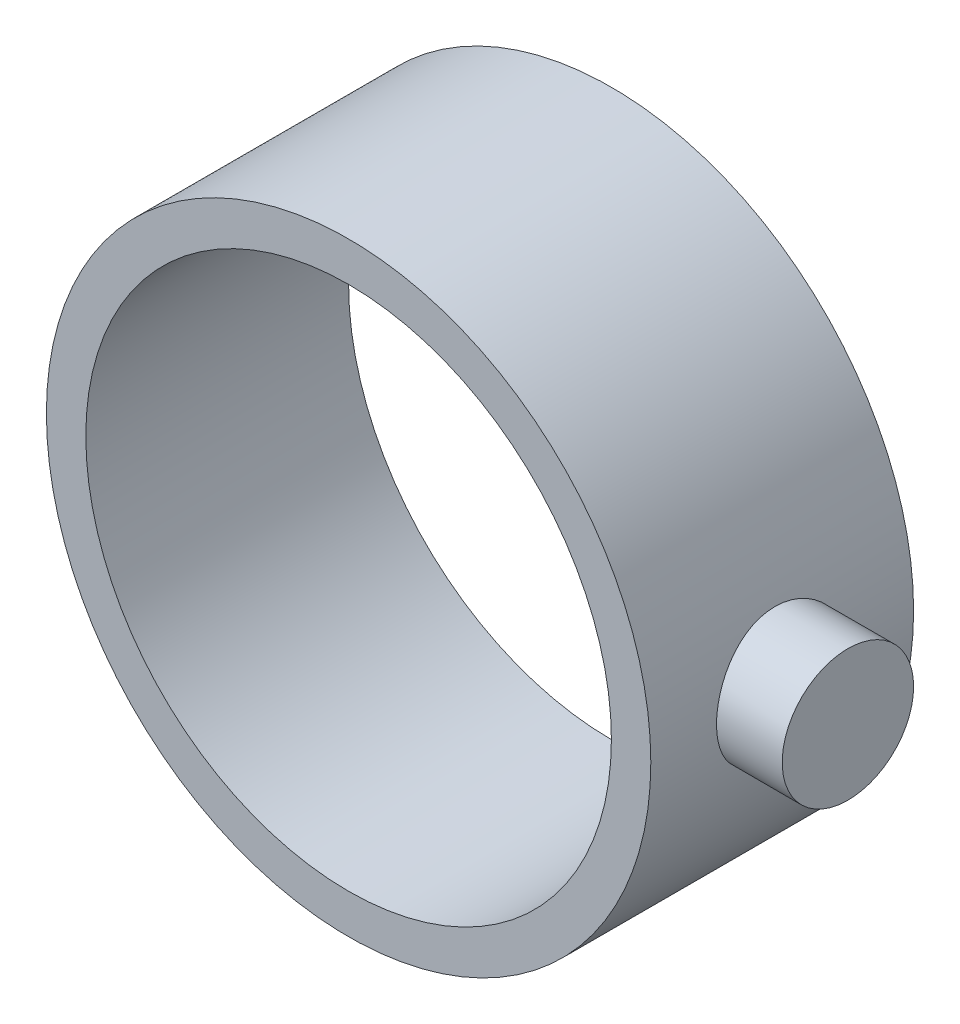
ISO-10303-21;
HEADER;
FILE_DESCRIPTION(('STEP AP214'),'2;1');
FILE_NAME('part.step','',(''),(''),'','','');
FILE_SCHEMA(('AUTOMOTIVE_DESIGN { 1 0 10303 214 1 1 1 1 }'));
ENDSEC;
DATA;
#1=APPLICATION_CONTEXT('core data for automotive mechanical design processes');
#2=APPLICATION_PROTOCOL_DEFINITION('international standard','automotive_design',2000,#1);
#3=PRODUCT_CONTEXT('',#1,'mechanical');
#4=PRODUCT('Part','Part','',(#3));
#5=PRODUCT_RELATED_PRODUCT_CATEGORY('part','',(#4));
#6=PRODUCT_DEFINITION_FORMATION('','',#4);
#7=PRODUCT_DEFINITION_CONTEXT('part definition',#1,'design');
#8=PRODUCT_DEFINITION('design','',#6,#7);
#9=PRODUCT_DEFINITION_SHAPE('','',#8);
#10=(LENGTH_UNIT() NAMED_UNIT(*) SI_UNIT(.MILLI.,.METRE.));
#11=(NAMED_UNIT(*) PLANE_ANGLE_UNIT() SI_UNIT($,.RADIAN.));
#12=(NAMED_UNIT(*) SI_UNIT($,.STERADIAN.) SOLID_ANGLE_UNIT());
#13=UNCERTAINTY_MEASURE_WITH_UNIT(LENGTH_MEASURE(1.E-05),#10,'distance_accuracy_value','');
#14=(GEOMETRIC_REPRESENTATION_CONTEXT(3) GLOBAL_UNCERTAINTY_ASSIGNED_CONTEXT((#13)) GLOBAL_UNIT_ASSIGNED_CONTEXT((#10,
#11,#12)) REPRESENTATION_CONTEXT('',''));
#15=CARTESIAN_POINT('',(0.,0.,0.));
#16=DIRECTION('',(0.,0.,1.));
#17=DIRECTION('',(1.,0.,0.));
#18=AXIS2_PLACEMENT_3D('',#15,#16,#17);
#19=CARTESIAN_POINT('',(0.,0.,10.));
#20=DIRECTION('',(0.,0.,-1.));
#21=DIRECTION('',(-1.,0.,0.));
#22=AXIS2_PLACEMENT_3D('',#19,#20,#21);
#23=CYLINDRICAL_SURFACE('',#22,23.);
#24=CARTESIAN_POINT('',(0.,0.,10.));
#25=DIRECTION('',(0.,0.,1.));
#26=DIRECTION('',(1.,0.,0.));
#27=AXIS2_PLACEMENT_3D('',#24,#25,#26);
#28=CIRCLE('',#27,23.);
#29=CARTESIAN_POINT('',(23.,0.,10.));
#30=VERTEX_POINT('',#29);
#31=EDGE_CURVE('E60',#30,#30,#28,.T.);
#32=ORIENTED_EDGE('',*,*,#31,.F.);
#33=EDGE_LOOP('',(#32));
#34=FACE_BOUND('',#33,.T.);
#35=CARTESIAN_POINT('',(0.,0.,-10.));
#36=DIRECTION('',(0.,0.,1.));
#37=DIRECTION('',(1.,0.,0.));
#38=AXIS2_PLACEMENT_3D('',#35,#36,#37);
#39=CIRCLE('',#38,23.);
#40=CARTESIAN_POINT('',(23.,0.,-10.));
#41=VERTEX_POINT('',#40);
#42=EDGE_CURVE('E64',#41,#41,#39,.T.);
#43=ORIENTED_EDGE('',*,*,#42,.T.);
#44=EDGE_LOOP('',(#43));
#45=FACE_BOUND('',#44,.T.);
#46=CARTESIAN_POINT('',(23.,0.,5.));
#47=CARTESIAN_POINT('',(22.9999948787908,-0.277355453021735,4.99999046988139));
#48=CARTESIAN_POINT('',(22.9949320658384,-0.554826451597986,4.97684426926349));
#49=CARTESIAN_POINT('',(22.9752244645296,-1.10188982362927,4.88496546905845));
#50=CARTESIAN_POINT('',(22.9605727725136,-1.3714763743546,4.81620002471381));
#51=CARTESIAN_POINT('',(22.9233191130524,-1.89478531778497,4.63533607587982));
#52=CARTESIAN_POINT('',(22.9007254017298,-2.14852386391351,4.52328255955596));
#53=CARTESIAN_POINT('',(22.8500275043336,-2.63358953148518,4.25916536071914));
#54=CARTESIAN_POINT('',(22.8219234744707,-2.86491728796833,4.10710281237018));
#55=CARTESIAN_POINT('',(22.7627863133394,-3.30227374035051,3.76473115788672));
#56=CARTESIAN_POINT('',(22.7317172223451,-3.50789604525701,3.57390908094913));
#57=CARTESIAN_POINT('',(22.6704056016113,-3.88448132114959,3.16053646966983));
#58=CARTESIAN_POINT('',(22.6401631450629,-4.05544123163079,2.9379831365794));
#59=CARTESIAN_POINT('',(22.5835746545545,-4.35963714550497,2.46446675724846));
#60=CARTESIAN_POINT('',(22.557274712874,-4.49244139028528,2.21322034105577));
#61=CARTESIAN_POINT('',(22.5120647650812,-4.7137868887183,1.69131047335477));
#62=CARTESIAN_POINT('',(22.4931538869724,-4.8023333656529,1.42064931747883));
#63=CARTESIAN_POINT('',(22.4652292670019,-4.93130849540492,0.871998768853098));
#64=CARTESIAN_POINT('',(22.4560677930734,-4.97245619365541,0.594186086550094));
#65=CARTESIAN_POINT('',(22.4482355157401,-5.00770133737134,0.035461164301097));
#66=CARTESIAN_POINT('',(22.4495634391116,-5.00180449319491,-0.245450695327231));
#67=CARTESIAN_POINT('',(22.462426132247,-4.94370678921264,-0.79706066607299));
#68=CARTESIAN_POINT('',(22.473776946623,-4.89234041368687,-1.06785160716671));
#69=CARTESIAN_POINT('',(22.5051157172028,-4.74608346550932,-1.59687823399897));
#70=CARTESIAN_POINT('',(22.5251041526852,-4.65119047766341,-1.85511322215631));
#71=CARTESIAN_POINT('',(22.5716477499978,-4.41980547322337,-2.35404788785886));
#72=CARTESIAN_POINT('',(22.5982533687249,-4.28299185482642,-2.59459351716295));
#73=CARTESIAN_POINT('',(22.6550024959988,-3.97187541590616,-3.04962178244774));
#74=CARTESIAN_POINT('',(22.685146480994,-3.79756754406677,-3.26410090058622));
#75=CARTESIAN_POINT('',(22.7463657181789,-3.41198948927908,-3.66571305572724));
#76=CARTESIAN_POINT('',(22.7774471114845,-3.20000952055627,-3.85216437338835));
#77=CARTESIAN_POINT('',(22.8364526695468,-2.74743924196488,-4.18698068172864));
#78=CARTESIAN_POINT('',(22.8643767784509,-2.50684842612282,-4.33534499870506));
#79=CARTESIAN_POINT('',(22.9140103871413,-2.00305938410198,-4.58994109331079));
#80=CARTESIAN_POINT('',(22.9357068090613,-1.73981507074034,-4.69608438628189));
#81=CARTESIAN_POINT('',(22.9703430978098,-1.19865085335277,-4.86244154718169));
#82=CARTESIAN_POINT('',(22.9832842221095,-0.920733062974753,-4.92266201089105));
#83=CARTESIAN_POINT('',(22.9987731031789,-0.363959336093369,-4.99447447644604));
#84=CARTESIAN_POINT('',(23.0015198929515,-0.0852289048502362,-5.00699783996082));
#85=CARTESIAN_POINT('',(22.9968679964225,0.470341330213604,-4.98558382951356));
#86=CARTESIAN_POINT('',(22.9894699894329,0.747181259377955,-4.95164956643012));
#87=CARTESIAN_POINT('',(22.965485278793,1.28803214676809,-4.83905597636461));
#88=CARTESIAN_POINT('',(22.9489988257175,1.55214947691155,-4.76088436632717));
#89=CARTESIAN_POINT('',(22.908682207042,2.06352339555358,-4.5625758112187));
#90=CARTESIAN_POINT('',(22.8848514210891,2.31077855760182,-4.44243532105245));
#91=CARTESIAN_POINT('',(22.8319982020036,2.78526633735584,-4.16165332702385));
#92=CARTESIAN_POINT('',(22.8029071864103,3.01216677511939,-4.00046367470686));
#93=CARTESIAN_POINT('',(22.7429019272679,3.43603237038221,-3.64288165209541));
#94=CARTESIAN_POINT('',(22.7119874503518,3.63299368467533,-3.44648476938197));
#95=CARTESIAN_POINT('',(22.6511332836046,3.99506577148533,-3.01979189064546));
#96=CARTESIAN_POINT('',(22.6212215538577,4.159532015727,-2.78894425475475));
#97=CARTESIAN_POINT('',(22.5664022842385,4.4473635873295,-2.30235696194783));
#98=CARTESIAN_POINT('',(22.5414945287845,4.57073068547922,-2.04661837809124));
#99=CARTESIAN_POINT('',(22.4997392968969,4.7720341612303,-1.51887566100499));
#100=CARTESIAN_POINT('',(22.4828468122899,4.8502247714914,-1.24697223924297));
#101=CARTESIAN_POINT('',(22.4589524877672,4.95970263165621,-0.693472130856892));
#102=CARTESIAN_POINT('',(22.4519490883793,4.99099727692893,-0.4118769797591));
#103=CARTESIAN_POINT('',(22.448723294638,5.00548311585466,0.146516635856377));
#104=CARTESIAN_POINT('',(22.4522719201584,4.98969596772686,0.423287764191401));
#105=CARTESIAN_POINT('',(22.4692329471859,4.91274819792238,0.970125148838159));
#106=CARTESIAN_POINT('',(22.482645235379,4.85158809749124,1.2401914821379));
#107=CARTESIAN_POINT('',(22.5177114095499,4.68612139525893,1.76515348862388));
#108=CARTESIAN_POINT('',(22.5393372046592,4.58196175101838,2.02009748306313));
#109=CARTESIAN_POINT('',(22.5884050738284,4.33357956265606,2.50904405682038));
#110=CARTESIAN_POINT('',(22.6158477452533,4.1893529033731,2.74304448182235));
#111=CARTESIAN_POINT('',(22.6741425132552,3.86153463545074,3.18850166471996));
#112=CARTESIAN_POINT('',(22.7050517676776,3.67721419715373,3.39941468834922));
#113=CARTESIAN_POINT('',(22.7664110384027,3.27591964577114,3.7876521518885));
#114=CARTESIAN_POINT('',(22.796860946966,3.05893799910332,3.96496882114789));
#115=CARTESIAN_POINT('',(22.8543320283237,2.59513904625375,4.28314767164195));
#116=CARTESIAN_POINT('',(22.8813044059173,2.34797586446562,4.42351497811907));
#117=CARTESIAN_POINT('',(22.9282925852266,1.83303166520972,4.66049163921965));
#118=CARTESIAN_POINT('',(22.948314250215,1.56526825915433,4.75713789569378));
#119=CARTESIAN_POINT('',(22.9755491570464,1.08101000415969,4.88659361134456));
#120=CARTESIAN_POINT('',(22.9846616635846,0.867145659166187,4.92904026257742));
#121=CARTESIAN_POINT('',(22.9968889660739,0.435544516373318,4.98574658873513));
#122=CARTESIAN_POINT('',(23.0000040216976,0.217807886644952,5.00000748402447));
#123=CARTESIAN_POINT('',(23.,0.,5.));
#124=B_SPLINE_CURVE_WITH_KNOTS('',3,(#46,#47,#48,#49,#50,#51,#52,#53,#54,#55,#56,#57,#58,#59,
#60,#61,#62,#63,#64,#65,#66,#67,#68,#69,#70,#71,#72,#73,#74,#75,#76,#77,#78,#79,#80,#81,#82,#83,
#84,#85,#86,#87,#88,#89,#90,#91,#92,#93,#94,#95,#96,#97,#98,#99,#100,#101,#102,#103,#104,#105,
#106,#107,#108,#109,#110,#111,#112,#113,#114,#115,#116,#117,#118,#119,#120,#121,#122,#123),
.UNSPECIFIED.,.T.,.F.,(4,2,2,2,2,2,2,2,2,2,2,2,2,2,2,2,2,2,2,2,2,2,2,2,2,2,2,2,2,2,2,2,2,2,2,2,
2,2,4),(0.,0.831269128673633,1.66313740158704,2.49414345123018,3.32512594630138,4.1679214133339,
5.01079126234425,5.8628536037949,6.71481536147197,7.55367510208783,8.39243302182475,
9.21610950175414,10.0398316911749,10.8700385218221,11.7003572700619,12.54840596434,
13.3964696583129,14.2463014329844,15.0960111254509,15.9290411979393,16.7620154921011,
17.5859803211863,18.4100147671011,19.2456896220706,20.0814716599851,20.9324565116634,
21.7834046932497,22.6295162753477,23.4754944138518,24.3032496459052,25.1309953688343,
25.9559352605888,26.7809599107533,27.6224659338828,28.4641663557266,29.3166242337088,
30.168361263619,30.8211871228156,31.4739847158573),.UNSPECIFIED.);
#125=CARTESIAN_POINT('',(23.,0.,5.));
#126=VERTEX_POINT('',#125);
#127=EDGE_CURVE('E12',#126,#126,#124,.T.);
#128=ORIENTED_EDGE('',*,*,#127,.F.);
#129=EDGE_LOOP('',(#128));
#130=FACE_BOUND('',#129,.T.);
#131=ADVANCED_FACE('F49',(#34,#45,#130),#23,.T.);
#132=CARTESIAN_POINT('',(0.,0.,10.));
#133=DIRECTION('',(0.,0.,1.));
#134=DIRECTION('',(1.,0.,0.));
#135=AXIS2_PLACEMENT_3D('',#132,#133,#134);
#136=PLANE('',#135);
#137=ORIENTED_EDGE('',*,*,#31,.T.);
#138=EDGE_LOOP('',(#137));
#139=FACE_BOUND('',#138,.T.);
#140=CARTESIAN_POINT('',(0.,0.,10.));
#141=DIRECTION('',(0.,0.,1.));
#142=DIRECTION('',(1.,0.,0.));
#143=AXIS2_PLACEMENT_3D('',#140,#141,#142);
#144=CIRCLE('',#143,20.);
#145=CARTESIAN_POINT('',(20.,0.,10.));
#146=VERTEX_POINT('',#145);
#147=EDGE_CURVE('E69',#146,#146,#144,.T.);
#148=ORIENTED_EDGE('',*,*,#147,.F.);
#149=EDGE_LOOP('',(#148));
#150=FACE_BOUND('',#149,.T.);
#151=ADVANCED_FACE('F95',(#139,#150),#136,.T.);
#152=CARTESIAN_POINT('',(0.,0.,-10.));
#153=DIRECTION('',(0.,0.,1.));
#154=DIRECTION('',(1.,0.,0.));
#155=AXIS2_PLACEMENT_3D('',#152,#153,#154);
#156=PLANE('',#155);
#157=ORIENTED_EDGE('',*,*,#42,.F.);
#158=EDGE_LOOP('',(#157));
#159=FACE_BOUND('',#158,.T.);
#160=CARTESIAN_POINT('',(0.,0.,-10.));
#161=DIRECTION('',(0.,0.,1.));
#162=DIRECTION('',(1.,0.,0.));
#163=AXIS2_PLACEMENT_3D('',#160,#161,#162);
#164=CIRCLE('',#163,20.);
#165=CARTESIAN_POINT('',(20.,0.,-10.));
#166=VERTEX_POINT('',#165);
#167=EDGE_CURVE('E71',#166,#166,#164,.T.);
#168=ORIENTED_EDGE('',*,*,#167,.T.);
#169=EDGE_LOOP('',(#168));
#170=FACE_BOUND('',#169,.T.);
#171=ADVANCED_FACE('F90',(#159,#170),#156,.F.);
#172=CARTESIAN_POINT('',(0.,0.,10.));
#173=DIRECTION('',(0.,0.,-1.));
#174=DIRECTION('',(-1.,0.,0.));
#175=AXIS2_PLACEMENT_3D('',#172,#173,#174);
#176=CYLINDRICAL_SURFACE('',#175,20.);
#177=ORIENTED_EDGE('',*,*,#147,.T.);
#178=EDGE_LOOP('',(#177));
#179=FACE_BOUND('',#178,.T.);
#180=ORIENTED_EDGE('',*,*,#167,.F.);
#181=EDGE_LOOP('',(#180));
#182=FACE_BOUND('',#181,.T.);
#183=ADVANCED_FACE('F84',(#179,#182),#176,.F.);
#184=CARTESIAN_POINT('',(28.,0.,0.));
#185=DIRECTION('',(-1.,0.,0.));
#186=DIRECTION('',(0.,0.,1.));
#187=AXIS2_PLACEMENT_3D('',#184,#185,#186);
#188=CYLINDRICAL_SURFACE('',#187,5.);
#189=CARTESIAN_POINT('',(28.,0.,0.));
#190=DIRECTION('',(1.,0.,0.));
#191=DIRECTION('',(0.,0.,-1.));
#192=AXIS2_PLACEMENT_3D('',#189,#190,#191);
#193=CIRCLE('',#192,5.);
#194=CARTESIAN_POINT('',(28.,0.,-5.));
#195=VERTEX_POINT('',#194);
#196=EDGE_CURVE('E74',#195,#195,#193,.T.);
#197=ORIENTED_EDGE('',*,*,#196,.F.);
#198=EDGE_LOOP('',(#197));
#199=FACE_BOUND('',#198,.T.);
#200=ORIENTED_EDGE('',*,*,#127,.T.);
#201=EDGE_LOOP('',(#200));
#202=FACE_BOUND('',#201,.T.);
#203=ADVANCED_FACE('F82',(#199,#202),#188,.T.);
#204=CARTESIAN_POINT('',(28.,0.,0.));
#205=DIRECTION('',(1.,0.,0.));
#206=DIRECTION('',(0.,0.,-1.));
#207=AXIS2_PLACEMENT_3D('',#204,#205,#206);
#208=PLANE('',#207);
#209=ORIENTED_EDGE('',*,*,#196,.T.);
#210=EDGE_LOOP('',(#209));
#211=FACE_BOUND('',#210,.T.);
#212=ADVANCED_FACE('F80',(#211),#208,.T.);
#213=CLOSED_SHELL('',(#131,#151,#171,#183,#203,#212));
#214=MANIFOLD_SOLID_BREP('B2',#213);
#215=ADVANCED_BREP_SHAPE_REPRESENTATION('',(#18,#214),#14);
#216=SHAPE_DEFINITION_REPRESENTATION(#9,#215);
ENDSEC;
END-ISO-10303-21;
